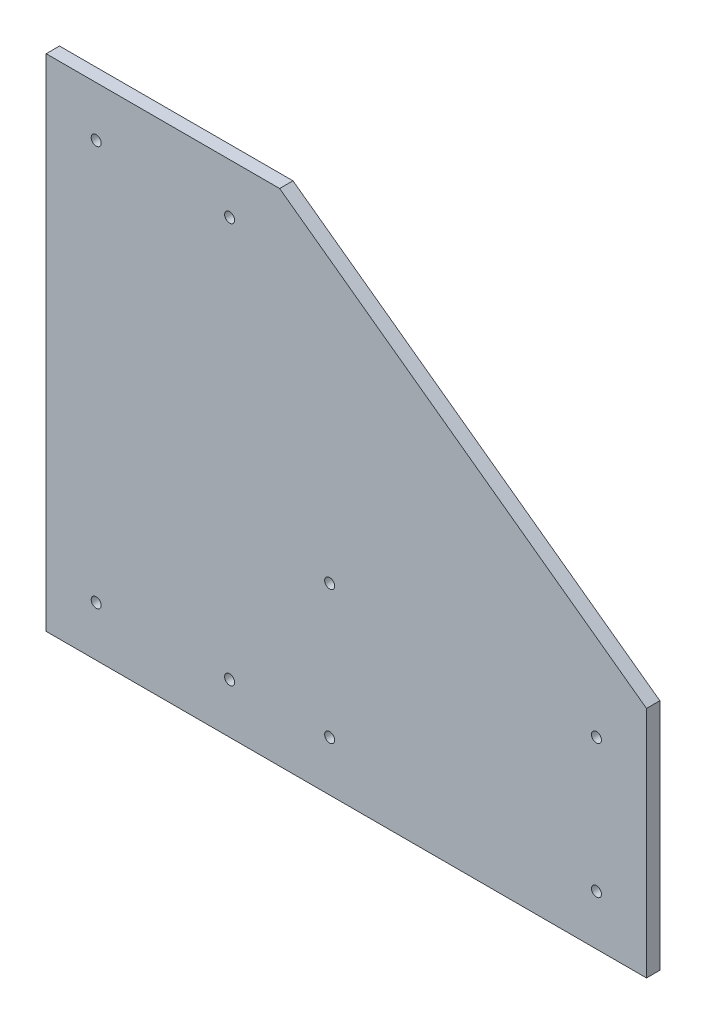
ISO-10303-21;
HEADER;
FILE_DESCRIPTION(('STEP AP214'),'2;1');
FILE_NAME('part.step','',(''),(''),'','','');
FILE_SCHEMA(('AUTOMOTIVE_DESIGN { 1 0 10303 214 1 1 1 1 }'));
ENDSEC;
DATA;
#1=APPLICATION_CONTEXT('core data for automotive mechanical design processes');
#2=APPLICATION_PROTOCOL_DEFINITION('international standard','automotive_design',2000,#1);
#3=PRODUCT_CONTEXT('',#1,'mechanical');
#4=PRODUCT('Part','Part','',(#3));
#5=PRODUCT_RELATED_PRODUCT_CATEGORY('part','',(#4));
#6=PRODUCT_DEFINITION_FORMATION('','',#4);
#7=PRODUCT_DEFINITION_CONTEXT('part definition',#1,'design');
#8=PRODUCT_DEFINITION('design','',#6,#7);
#9=PRODUCT_DEFINITION_SHAPE('','',#8);
#10=(LENGTH_UNIT() NAMED_UNIT(*) SI_UNIT(.MILLI.,.METRE.));
#11=(NAMED_UNIT(*) PLANE_ANGLE_UNIT() SI_UNIT($,.RADIAN.));
#12=(NAMED_UNIT(*) SI_UNIT($,.STERADIAN.) SOLID_ANGLE_UNIT());
#13=UNCERTAINTY_MEASURE_WITH_UNIT(LENGTH_MEASURE(1.E-05),#10,'distance_accuracy_value','');
#14=(GEOMETRIC_REPRESENTATION_CONTEXT(3) GLOBAL_UNCERTAINTY_ASSIGNED_CONTEXT((#13)) GLOBAL_UNIT_ASSIGNED_CONTEXT((#10,
#11,#12)) REPRESENTATION_CONTEXT('',''));
#15=CARTESIAN_POINT('',(0.,0.,0.));
#16=DIRECTION('',(0.,0.,1.));
#17=DIRECTION('',(1.,0.,0.));
#18=AXIS2_PLACEMENT_3D('',#15,#16,#17);
#19=CARTESIAN_POINT('',(0.,190.5,5.08));
#20=DIRECTION('',(1.,0.,0.));
#21=DIRECTION('',(0.,1.,0.));
#22=AXIS2_PLACEMENT_3D('',#19,#20,#21);
#23=PLANE('',#22);
#24=DIRECTION('',(0.,-1.,0.));
#25=VECTOR('',#24,1.);
#26=CARTESIAN_POINT('',(0.,190.5,0.));
#27=LINE('',#26,#25);
#28=CARTESIAN_POINT('',(0.,190.5,0.));
#29=VERTEX_POINT('',#28);
#30=CARTESIAN_POINT('',(0.,0.,0.));
#31=VERTEX_POINT('',#30);
#32=EDGE_CURVE('E107',#29,#31,#27,.T.);
#33=ORIENTED_EDGE('',*,*,#32,.T.);
#34=DIRECTION('',(0.,0.,-1.));
#35=VECTOR('',#34,1.);
#36=CARTESIAN_POINT('',(0.,0.,5.08));
#37=LINE('',#36,#35);
#38=CARTESIAN_POINT('',(0.,0.,5.08));
#39=VERTEX_POINT('',#38);
#40=EDGE_CURVE('E11',#39,#31,#37,.T.);
#41=ORIENTED_EDGE('',*,*,#40,.F.);
#42=DIRECTION('',(0.,-1.,0.));
#43=VECTOR('',#42,1.);
#44=CARTESIAN_POINT('',(0.,190.5,5.08));
#45=LINE('',#44,#43);
#46=CARTESIAN_POINT('',(0.,190.5,5.08));
#47=VERTEX_POINT('',#46);
#48=EDGE_CURVE('E116',#47,#39,#45,.T.);
#49=ORIENTED_EDGE('',*,*,#48,.F.);
#50=DIRECTION('',(0.,0.,-1.));
#51=VECTOR('',#50,1.);
#52=CARTESIAN_POINT('',(0.,190.5,5.08));
#53=LINE('',#52,#51);
#54=EDGE_CURVE('E103',#47,#29,#53,.T.);
#55=ORIENTED_EDGE('',*,*,#54,.T.);
#56=EDGE_LOOP('',(#33,#41,#49,#55));
#57=FACE_BOUND('',#56,.T.);
#58=ADVANCED_FACE('F33',(#57),#23,.F.);
#59=CARTESIAN_POINT('',(0.,0.,5.08));
#60=DIRECTION('',(0.,1.,0.));
#61=DIRECTION('',(0.,0.,1.));
#62=AXIS2_PLACEMENT_3D('',#59,#60,#61);
#63=PLANE('',#62);
#64=DIRECTION('',(1.,0.,0.));
#65=VECTOR('',#64,1.);
#66=CARTESIAN_POINT('',(0.,0.,0.));
#67=LINE('',#66,#65);
#68=CARTESIAN_POINT('',(228.6,0.,0.));
#69=VERTEX_POINT('',#68);
#70=EDGE_CURVE('E110',#31,#69,#67,.T.);
#71=ORIENTED_EDGE('',*,*,#70,.T.);
#72=DIRECTION('',(0.,0.,-1.));
#73=VECTOR('',#72,1.);
#74=CARTESIAN_POINT('',(228.6,0.,5.08));
#75=LINE('',#74,#73);
#76=CARTESIAN_POINT('',(228.6,0.,5.08));
#77=VERTEX_POINT('',#76);
#78=EDGE_CURVE('E41',#77,#69,#75,.T.);
#79=ORIENTED_EDGE('',*,*,#78,.F.);
#80=DIRECTION('',(1.,0.,0.));
#81=VECTOR('',#80,1.);
#82=CARTESIAN_POINT('',(0.,0.,5.08));
#83=LINE('',#82,#81);
#84=EDGE_CURVE('E83',#39,#77,#83,.T.);
#85=ORIENTED_EDGE('',*,*,#84,.F.);
#86=ORIENTED_EDGE('',*,*,#40,.T.);
#87=EDGE_LOOP('',(#71,#79,#85,#86));
#88=FACE_BOUND('',#87,.T.);
#89=ADVANCED_FACE('F136',(#88),#63,.F.);
#90=CARTESIAN_POINT('',(228.6,0.,5.08));
#91=DIRECTION('',(-1.,0.,0.));
#92=DIRECTION('',(0.,0.,1.));
#93=AXIS2_PLACEMENT_3D('',#90,#91,#92);
#94=PLANE('',#93);
#95=DIRECTION('',(0.,1.,0.));
#96=VECTOR('',#95,1.);
#97=CARTESIAN_POINT('',(228.6,0.,0.));
#98=LINE('',#97,#96);
#99=CARTESIAN_POINT('',(228.6,88.9,0.));
#100=VERTEX_POINT('',#99);
#101=EDGE_CURVE('E98',#69,#100,#98,.T.);
#102=ORIENTED_EDGE('',*,*,#101,.T.);
#103=DIRECTION('',(0.,0.,-1.));
#104=VECTOR('',#103,1.);
#105=CARTESIAN_POINT('',(228.6,88.9,5.08));
#106=LINE('',#105,#104);
#107=CARTESIAN_POINT('',(228.6,88.9,5.08));
#108=VERTEX_POINT('',#107);
#109=EDGE_CURVE('E95',#108,#100,#106,.T.);
#110=ORIENTED_EDGE('',*,*,#109,.F.);
#111=DIRECTION('',(0.,1.,0.));
#112=VECTOR('',#111,1.);
#113=CARTESIAN_POINT('',(228.6,0.,5.08));
#114=LINE('',#113,#112);
#115=EDGE_CURVE('E87',#77,#108,#114,.T.);
#116=ORIENTED_EDGE('',*,*,#115,.F.);
#117=ORIENTED_EDGE('',*,*,#78,.T.);
#118=EDGE_LOOP('',(#102,#110,#116,#117));
#119=FACE_BOUND('',#118,.T.);
#120=ADVANCED_FACE('F96',(#119),#94,.F.);
#121=CARTESIAN_POINT('',(228.6,88.9,5.08));
#122=DIRECTION('',(-0.588171697675046,-0.808736084303189,0.));
#123=DIRECTION('',(0.808736084303189,-0.588171697675046,0.));
#124=AXIS2_PLACEMENT_3D('',#121,#122,#123);
#125=PLANE('',#124);
#126=DIRECTION('',(-0.808736084303189,0.588171697675046,0.));
#127=VECTOR('',#126,1.);
#128=CARTESIAN_POINT('',(228.6,88.9,0.));
#129=LINE('',#128,#127);
#130=CARTESIAN_POINT('',(88.8999999999999,190.5,0.));
#131=VERTEX_POINT('',#130);
#132=EDGE_CURVE('E69',#100,#131,#129,.T.);
#133=ORIENTED_EDGE('',*,*,#132,.T.);
#134=DIRECTION('',(0.,0.,-1.));
#135=VECTOR('',#134,1.);
#136=CARTESIAN_POINT('',(88.8999999999999,190.5,5.08));
#137=LINE('',#136,#135);
#138=CARTESIAN_POINT('',(88.8999999999999,190.5,5.08));
#139=VERTEX_POINT('',#138);
#140=EDGE_CURVE('E99',#139,#131,#137,.T.);
#141=ORIENTED_EDGE('',*,*,#140,.F.);
#142=DIRECTION('',(-0.808736084303189,0.588171697675046,0.));
#143=VECTOR('',#142,1.);
#144=CARTESIAN_POINT('',(228.6,88.9,5.08));
#145=LINE('',#144,#143);
#146=EDGE_CURVE('E91',#108,#139,#145,.T.);
#147=ORIENTED_EDGE('',*,*,#146,.F.);
#148=ORIENTED_EDGE('',*,*,#109,.T.);
#149=EDGE_LOOP('',(#133,#141,#147,#148));
#150=FACE_BOUND('',#149,.T.);
#151=ADVANCED_FACE('F101',(#150),#125,.F.);
#152=CARTESIAN_POINT('',(88.8999999999999,190.5,5.08));
#153=DIRECTION('',(0.,-1.,0.));
#154=DIRECTION('',(0.,0.,-1.));
#155=AXIS2_PLACEMENT_3D('',#152,#153,#154);
#156=PLANE('',#155);
#157=DIRECTION('',(-1.,0.,0.));
#158=VECTOR('',#157,1.);
#159=CARTESIAN_POINT('',(88.8999999999999,190.5,0.));
#160=LINE('',#159,#158);
#161=EDGE_CURVE('E75',#131,#29,#160,.T.);
#162=ORIENTED_EDGE('',*,*,#161,.T.);
#163=ORIENTED_EDGE('',*,*,#54,.F.);
#164=DIRECTION('',(-1.,0.,0.));
#165=VECTOR('',#164,1.);
#166=CARTESIAN_POINT('',(88.8999999999999,190.5,5.08));
#167=LINE('',#166,#165);
#168=EDGE_CURVE('E49',#139,#47,#167,.T.);
#169=ORIENTED_EDGE('',*,*,#168,.F.);
#170=ORIENTED_EDGE('',*,*,#140,.T.);
#171=EDGE_LOOP('',(#162,#163,#169,#170));
#172=FACE_BOUND('',#171,.T.);
#173=ADVANCED_FACE('F124',(#172),#156,.F.);
#174=CARTESIAN_POINT('',(0.,0.,5.08));
#175=DIRECTION('',(0.,0.,1.));
#176=DIRECTION('',(1.,0.,0.));
#177=AXIS2_PLACEMENT_3D('',#174,#175,#176);
#178=PLANE('',#177);
#179=CARTESIAN_POINT('',(19.05,171.45,5.08));
#180=DIRECTION('',(0.,0.,1.));
#181=DIRECTION('',(1.,0.,0.));
#182=AXIS2_PLACEMENT_3D('',#179,#180,#181);
#183=CIRCLE('',#182,1.89864999999999);
#184=CARTESIAN_POINT('',(20.9486499999999,171.45,5.08));
#185=VERTEX_POINT('',#184);
#186=EDGE_CURVE('E258',#185,#185,#183,.T.);
#187=ORIENTED_EDGE('',*,*,#186,.F.);
#188=EDGE_LOOP('',(#187));
#189=FACE_BOUND('',#188,.T.);
#190=CARTESIAN_POINT('',(69.8499999999999,171.45,5.08));
#191=DIRECTION('',(0.,0.,1.));
#192=DIRECTION('',(1.,0.,0.));
#193=AXIS2_PLACEMENT_3D('',#190,#191,#192);
#194=CIRCLE('',#193,1.89864999999999);
#195=CARTESIAN_POINT('',(71.7486499999999,171.45,5.08));
#196=VERTEX_POINT('',#195);
#197=EDGE_CURVE('E260',#196,#196,#194,.T.);
#198=ORIENTED_EDGE('',*,*,#197,.F.);
#199=EDGE_LOOP('',(#198));
#200=FACE_BOUND('',#199,.T.);
#201=CARTESIAN_POINT('',(69.8499999999999,19.05,5.08));
#202=DIRECTION('',(0.,0.,1.));
#203=DIRECTION('',(1.,0.,0.));
#204=AXIS2_PLACEMENT_3D('',#201,#202,#203);
#205=CIRCLE('',#204,1.89864999999999);
#206=CARTESIAN_POINT('',(71.7486499999999,19.05,5.08));
#207=VERTEX_POINT('',#206);
#208=EDGE_CURVE('E268',#207,#207,#205,.T.);
#209=ORIENTED_EDGE('',*,*,#208,.F.);
#210=EDGE_LOOP('',(#209));
#211=FACE_BOUND('',#210,.T.);
#212=CARTESIAN_POINT('',(19.05,19.05,5.08));
#213=DIRECTION('',(0.,0.,1.));
#214=DIRECTION('',(1.,0.,0.));
#215=AXIS2_PLACEMENT_3D('',#212,#213,#214);
#216=CIRCLE('',#215,1.89864999999999);
#217=CARTESIAN_POINT('',(20.9486499999999,19.05,5.08));
#218=VERTEX_POINT('',#217);
#219=EDGE_CURVE('E274',#218,#218,#216,.T.);
#220=ORIENTED_EDGE('',*,*,#219,.F.);
#221=EDGE_LOOP('',(#220));
#222=FACE_BOUND('',#221,.T.);
#223=CARTESIAN_POINT('',(107.95,19.05,5.08));
#224=DIRECTION('',(0.,0.,1.));
#225=DIRECTION('',(1.,0.,0.));
#226=AXIS2_PLACEMENT_3D('',#223,#224,#225);
#227=CIRCLE('',#226,1.89864999999999);
#228=CARTESIAN_POINT('',(109.84865,19.05,5.08));
#229=VERTEX_POINT('',#228);
#230=EDGE_CURVE('E280',#229,#229,#227,.T.);
#231=ORIENTED_EDGE('',*,*,#230,.F.);
#232=EDGE_LOOP('',(#231));
#233=FACE_BOUND('',#232,.T.);
#234=CARTESIAN_POINT('',(107.95,69.8499999999999,5.08));
#235=DIRECTION('',(0.,0.,1.));
#236=DIRECTION('',(1.,0.,0.));
#237=AXIS2_PLACEMENT_3D('',#234,#235,#236);
#238=CIRCLE('',#237,1.89864999999999);
#239=CARTESIAN_POINT('',(109.84865,69.8499999999999,5.08));
#240=VERTEX_POINT('',#239);
#241=EDGE_CURVE('E286',#240,#240,#238,.T.);
#242=ORIENTED_EDGE('',*,*,#241,.F.);
#243=EDGE_LOOP('',(#242));
#244=FACE_BOUND('',#243,.T.);
#245=CARTESIAN_POINT('',(209.55,69.85,5.08));
#246=DIRECTION('',(0.,0.,1.));
#247=DIRECTION('',(1.,0.,0.));
#248=AXIS2_PLACEMENT_3D('',#245,#246,#247);
#249=CIRCLE('',#248,1.89865);
#250=CARTESIAN_POINT('',(211.44865,69.85,5.08));
#251=VERTEX_POINT('',#250);
#252=EDGE_CURVE('E292',#251,#251,#249,.T.);
#253=ORIENTED_EDGE('',*,*,#252,.F.);
#254=EDGE_LOOP('',(#253));
#255=FACE_BOUND('',#254,.T.);
#256=CARTESIAN_POINT('',(209.55,19.05,5.08));
#257=DIRECTION('',(0.,0.,1.));
#258=DIRECTION('',(1.,0.,0.));
#259=AXIS2_PLACEMENT_3D('',#256,#257,#258);
#260=CIRCLE('',#259,1.89865);
#261=CARTESIAN_POINT('',(211.44865,19.05,5.08));
#262=VERTEX_POINT('',#261);
#263=EDGE_CURVE('E298',#262,#262,#260,.T.);
#264=ORIENTED_EDGE('',*,*,#263,.F.);
#265=EDGE_LOOP('',(#264));
#266=FACE_BOUND('',#265,.T.);
#267=ORIENTED_EDGE('',*,*,#48,.T.);
#268=ORIENTED_EDGE('',*,*,#84,.T.);
#269=ORIENTED_EDGE('',*,*,#115,.T.);
#270=ORIENTED_EDGE('',*,*,#146,.T.);
#271=ORIENTED_EDGE('',*,*,#168,.T.);
#272=EDGE_LOOP('',(#267,#268,#269,#270,#271));
#273=FACE_BOUND('',#272,.T.);
#274=ADVANCED_FACE('F89',(#189,#200,#211,#222,#233,#244,#255,#266,#273),#178,.T.);
#275=CARTESIAN_POINT('',(0.,0.,0.));
#276=DIRECTION('',(0.,0.,1.));
#277=DIRECTION('',(1.,0.,0.));
#278=AXIS2_PLACEMENT_3D('',#275,#276,#277);
#279=PLANE('',#278);
#280=CARTESIAN_POINT('',(19.05,171.45,0.));
#281=DIRECTION('',(0.,0.,1.));
#282=DIRECTION('',(1.,0.,0.));
#283=AXIS2_PLACEMENT_3D('',#280,#281,#282);
#284=CIRCLE('',#283,1.89865);
#285=CARTESIAN_POINT('',(20.94865,171.45,0.));
#286=VERTEX_POINT('',#285);
#287=EDGE_CURVE('E255',#286,#286,#284,.T.);
#288=ORIENTED_EDGE('',*,*,#287,.T.);
#289=EDGE_LOOP('',(#288));
#290=FACE_BOUND('',#289,.T.);
#291=CARTESIAN_POINT('',(69.8499999999999,171.45,0.));
#292=DIRECTION('',(0.,0.,1.));
#293=DIRECTION('',(1.,0.,0.));
#294=AXIS2_PLACEMENT_3D('',#291,#292,#293);
#295=CIRCLE('',#294,1.89865);
#296=CARTESIAN_POINT('',(71.7486499999999,171.45,0.));
#297=VERTEX_POINT('',#296);
#298=EDGE_CURVE('E265',#297,#297,#295,.T.);
#299=ORIENTED_EDGE('',*,*,#298,.T.);
#300=EDGE_LOOP('',(#299));
#301=FACE_BOUND('',#300,.T.);
#302=CARTESIAN_POINT('',(69.8499999999999,19.05,0.));
#303=DIRECTION('',(0.,0.,1.));
#304=DIRECTION('',(1.,0.,0.));
#305=AXIS2_PLACEMENT_3D('',#302,#303,#304);
#306=CIRCLE('',#305,1.89865);
#307=CARTESIAN_POINT('',(71.7486499999999,19.05,0.));
#308=VERTEX_POINT('',#307);
#309=EDGE_CURVE('E271',#308,#308,#306,.T.);
#310=ORIENTED_EDGE('',*,*,#309,.T.);
#311=EDGE_LOOP('',(#310));
#312=FACE_BOUND('',#311,.T.);
#313=CARTESIAN_POINT('',(19.05,19.05,0.));
#314=DIRECTION('',(0.,0.,1.));
#315=DIRECTION('',(1.,0.,0.));
#316=AXIS2_PLACEMENT_3D('',#313,#314,#315);
#317=CIRCLE('',#316,1.89865);
#318=CARTESIAN_POINT('',(20.94865,19.05,0.));
#319=VERTEX_POINT('',#318);
#320=EDGE_CURVE('E277',#319,#319,#317,.T.);
#321=ORIENTED_EDGE('',*,*,#320,.T.);
#322=EDGE_LOOP('',(#321));
#323=FACE_BOUND('',#322,.T.);
#324=CARTESIAN_POINT('',(107.95,19.05,0.));
#325=DIRECTION('',(0.,0.,1.));
#326=DIRECTION('',(1.,0.,0.));
#327=AXIS2_PLACEMENT_3D('',#324,#325,#326);
#328=CIRCLE('',#327,1.89865);
#329=CARTESIAN_POINT('',(109.84865,19.05,0.));
#330=VERTEX_POINT('',#329);
#331=EDGE_CURVE('E283',#330,#330,#328,.T.);
#332=ORIENTED_EDGE('',*,*,#331,.T.);
#333=EDGE_LOOP('',(#332));
#334=FACE_BOUND('',#333,.T.);
#335=CARTESIAN_POINT('',(107.95,69.8499999999999,0.));
#336=DIRECTION('',(0.,0.,1.));
#337=DIRECTION('',(1.,0.,0.));
#338=AXIS2_PLACEMENT_3D('',#335,#336,#337);
#339=CIRCLE('',#338,1.89865);
#340=CARTESIAN_POINT('',(109.84865,69.8499999999999,0.));
#341=VERTEX_POINT('',#340);
#342=EDGE_CURVE('E289',#341,#341,#339,.T.);
#343=ORIENTED_EDGE('',*,*,#342,.T.);
#344=EDGE_LOOP('',(#343));
#345=FACE_BOUND('',#344,.T.);
#346=CARTESIAN_POINT('',(209.55,69.85,0.));
#347=DIRECTION('',(0.,0.,1.));
#348=DIRECTION('',(1.,0.,0.));
#349=AXIS2_PLACEMENT_3D('',#346,#347,#348);
#350=CIRCLE('',#349,1.89865);
#351=CARTESIAN_POINT('',(211.44865,69.85,0.));
#352=VERTEX_POINT('',#351);
#353=EDGE_CURVE('E295',#352,#352,#350,.T.);
#354=ORIENTED_EDGE('',*,*,#353,.T.);
#355=EDGE_LOOP('',(#354));
#356=FACE_BOUND('',#355,.T.);
#357=CARTESIAN_POINT('',(209.55,19.05,0.));
#358=DIRECTION('',(0.,0.,1.));
#359=DIRECTION('',(1.,0.,0.));
#360=AXIS2_PLACEMENT_3D('',#357,#358,#359);
#361=CIRCLE('',#360,1.89865);
#362=CARTESIAN_POINT('',(211.44865,19.05,0.));
#363=VERTEX_POINT('',#362);
#364=EDGE_CURVE('E111',#363,#363,#361,.T.);
#365=ORIENTED_EDGE('',*,*,#364,.T.);
#366=EDGE_LOOP('',(#365));
#367=FACE_BOUND('',#366,.T.);
#368=ORIENTED_EDGE('',*,*,#32,.F.);
#369=ORIENTED_EDGE('',*,*,#161,.F.);
#370=ORIENTED_EDGE('',*,*,#132,.F.);
#371=ORIENTED_EDGE('',*,*,#101,.F.);
#372=ORIENTED_EDGE('',*,*,#70,.F.);
#373=EDGE_LOOP('',(#368,#369,#370,#371,#372));
#374=FACE_BOUND('',#373,.T.);
#375=ADVANCED_FACE('F120',(#290,#301,#312,#323,#334,#345,#356,#367,#374),#279,.F.);
#376=CARTESIAN_POINT('',(209.55,19.05,5.08));
#377=DIRECTION('',(0.,0.,1.));
#378=DIRECTION('',(1.,0.,0.));
#379=AXIS2_PLACEMENT_3D('',#376,#377,#378);
#380=CYLINDRICAL_SURFACE('',#379,1.89865);
#381=ORIENTED_EDGE('',*,*,#364,.F.);
#382=EDGE_LOOP('',(#381));
#383=FACE_BOUND('',#382,.T.);
#384=ORIENTED_EDGE('',*,*,#263,.T.);
#385=EDGE_LOOP('',(#384));
#386=FACE_BOUND('',#385,.T.);
#387=ADVANCED_FACE('F169',(#383,#386),#380,.F.);
#388=CARTESIAN_POINT('',(209.55,69.85,5.08));
#389=DIRECTION('',(0.,0.,1.));
#390=DIRECTION('',(1.,0.,0.));
#391=AXIS2_PLACEMENT_3D('',#388,#389,#390);
#392=CYLINDRICAL_SURFACE('',#391,1.89865);
#393=ORIENTED_EDGE('',*,*,#353,.F.);
#394=EDGE_LOOP('',(#393));
#395=FACE_BOUND('',#394,.T.);
#396=ORIENTED_EDGE('',*,*,#252,.T.);
#397=EDGE_LOOP('',(#396));
#398=FACE_BOUND('',#397,.T.);
#399=ADVANCED_FACE('F178',(#395,#398),#392,.F.);
#400=CARTESIAN_POINT('',(107.95,69.8499999999999,5.08));
#401=DIRECTION('',(0.,0.,1.));
#402=DIRECTION('',(1.,0.,0.));
#403=AXIS2_PLACEMENT_3D('',#400,#401,#402);
#404=CYLINDRICAL_SURFACE('',#403,1.89864999999999);
#405=ORIENTED_EDGE('',*,*,#342,.F.);
#406=EDGE_LOOP('',(#405));
#407=FACE_BOUND('',#406,.T.);
#408=ORIENTED_EDGE('',*,*,#241,.T.);
#409=EDGE_LOOP('',(#408));
#410=FACE_BOUND('',#409,.T.);
#411=ADVANCED_FACE('F188',(#407,#410),#404,.F.);
#412=CARTESIAN_POINT('',(107.95,19.05,5.08));
#413=DIRECTION('',(0.,0.,1.));
#414=DIRECTION('',(1.,0.,0.));
#415=AXIS2_PLACEMENT_3D('',#412,#413,#414);
#416=CYLINDRICAL_SURFACE('',#415,1.89864999999999);
#417=ORIENTED_EDGE('',*,*,#331,.F.);
#418=EDGE_LOOP('',(#417));
#419=FACE_BOUND('',#418,.T.);
#420=ORIENTED_EDGE('',*,*,#230,.T.);
#421=EDGE_LOOP('',(#420));
#422=FACE_BOUND('',#421,.T.);
#423=ADVANCED_FACE('F198',(#419,#422),#416,.F.);
#424=CARTESIAN_POINT('',(19.05,19.05,5.08));
#425=DIRECTION('',(0.,0.,1.));
#426=DIRECTION('',(1.,0.,0.));
#427=AXIS2_PLACEMENT_3D('',#424,#425,#426);
#428=CYLINDRICAL_SURFACE('',#427,1.89864999999999);
#429=ORIENTED_EDGE('',*,*,#320,.F.);
#430=EDGE_LOOP('',(#429));
#431=FACE_BOUND('',#430,.T.);
#432=ORIENTED_EDGE('',*,*,#219,.T.);
#433=EDGE_LOOP('',(#432));
#434=FACE_BOUND('',#433,.T.);
#435=ADVANCED_FACE('F208',(#431,#434),#428,.F.);
#436=CARTESIAN_POINT('',(69.8499999999999,19.05,5.08));
#437=DIRECTION('',(0.,0.,1.));
#438=DIRECTION('',(1.,0.,0.));
#439=AXIS2_PLACEMENT_3D('',#436,#437,#438);
#440=CYLINDRICAL_SURFACE('',#439,1.89864999999999);
#441=ORIENTED_EDGE('',*,*,#309,.F.);
#442=EDGE_LOOP('',(#441));
#443=FACE_BOUND('',#442,.T.);
#444=ORIENTED_EDGE('',*,*,#208,.T.);
#445=EDGE_LOOP('',(#444));
#446=FACE_BOUND('',#445,.T.);
#447=ADVANCED_FACE('F218',(#443,#446),#440,.F.);
#448=CARTESIAN_POINT('',(69.8499999999999,171.45,5.08));
#449=DIRECTION('',(0.,0.,1.));
#450=DIRECTION('',(1.,0.,0.));
#451=AXIS2_PLACEMENT_3D('',#448,#449,#450);
#452=CYLINDRICAL_SURFACE('',#451,1.89864999999999);
#453=ORIENTED_EDGE('',*,*,#298,.F.);
#454=EDGE_LOOP('',(#453));
#455=FACE_BOUND('',#454,.T.);
#456=ORIENTED_EDGE('',*,*,#197,.T.);
#457=EDGE_LOOP('',(#456));
#458=FACE_BOUND('',#457,.T.);
#459=ADVANCED_FACE('F228',(#455,#458),#452,.F.);
#460=CARTESIAN_POINT('',(19.05,171.45,5.08));
#461=DIRECTION('',(0.,0.,1.));
#462=DIRECTION('',(1.,0.,0.));
#463=AXIS2_PLACEMENT_3D('',#460,#461,#462);
#464=CYLINDRICAL_SURFACE('',#463,1.89864999999999);
#465=ORIENTED_EDGE('',*,*,#287,.F.);
#466=EDGE_LOOP('',(#465));
#467=FACE_BOUND('',#466,.T.);
#468=ORIENTED_EDGE('',*,*,#186,.T.);
#469=EDGE_LOOP('',(#468));
#470=FACE_BOUND('',#469,.T.);
#471=ADVANCED_FACE('F238',(#467,#470),#464,.F.);
#472=CLOSED_SHELL('',(#58,#89,#120,#151,#173,#274,#375,#387,#399,#411,#423,#435,#447,#459,#471));
#473=MANIFOLD_SOLID_BREP('B2',#472);
#474=ADVANCED_BREP_SHAPE_REPRESENTATION('',(#18,#473),#14);
#475=SHAPE_DEFINITION_REPRESENTATION(#9,#474);
ENDSEC;
END-ISO-10303-21;
